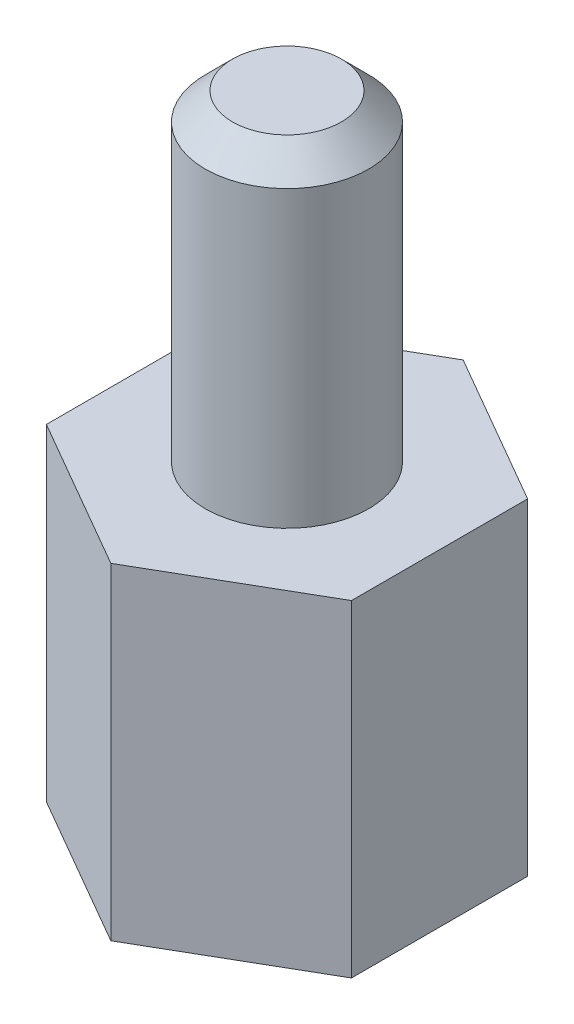
ISO-10303-21;
HEADER;
FILE_DESCRIPTION(('STEP AP214'),'2;1');
FILE_NAME('part.step','',(''),(''),'','','');
FILE_SCHEMA(('AUTOMOTIVE_DESIGN { 1 0 10303 214 1 1 1 1 }'));
ENDSEC;
DATA;
#1=APPLICATION_CONTEXT('core data for automotive mechanical design processes');
#2=APPLICATION_PROTOCOL_DEFINITION('international standard','automotive_design',2000,#1);
#3=PRODUCT_CONTEXT('',#1,'mechanical');
#4=PRODUCT('Part','Part','',(#3));
#5=PRODUCT_RELATED_PRODUCT_CATEGORY('part','',(#4));
#6=PRODUCT_DEFINITION_FORMATION('','',#4);
#7=PRODUCT_DEFINITION_CONTEXT('part definition',#1,'design');
#8=PRODUCT_DEFINITION('design','',#6,#7);
#9=PRODUCT_DEFINITION_SHAPE('','',#8);
#10=(LENGTH_UNIT() NAMED_UNIT(*) SI_UNIT(.MILLI.,.METRE.));
#11=(NAMED_UNIT(*) PLANE_ANGLE_UNIT() SI_UNIT($,.RADIAN.));
#12=(NAMED_UNIT(*) SI_UNIT($,.STERADIAN.) SOLID_ANGLE_UNIT());
#13=UNCERTAINTY_MEASURE_WITH_UNIT(LENGTH_MEASURE(1.E-05),#10,'distance_accuracy_value','');
#14=(GEOMETRIC_REPRESENTATION_CONTEXT(3) GLOBAL_UNCERTAINTY_ASSIGNED_CONTEXT((#13)) GLOBAL_UNIT_ASSIGNED_CONTEXT((#10,
#11,#12)) REPRESENTATION_CONTEXT('',''));
#15=CARTESIAN_POINT('',(0.,0.,0.));
#16=DIRECTION('',(0.,0.,1.));
#17=DIRECTION('',(1.,0.,0.));
#18=AXIS2_PLACEMENT_3D('',#15,#16,#17);
#19=CARTESIAN_POINT('',(-2.79999999999998,6.,1.61658075373099));
#20=DIRECTION('',(0.499999999999995,0.,-0.866025403784441));
#21=DIRECTION('',(-0.866025403784442,0.,-0.499999999999995));
#22=AXIS2_PLACEMENT_3D('',#19,#20,#21);
#23=PLANE('',#22);
#24=DIRECTION('',(0.866025403784442,0.,0.499999999999995));
#25=VECTOR('',#24,1.);
#26=CARTESIAN_POINT('',(-2.79999999999998,0.,1.61658075373099));
#27=LINE('',#26,#25);
#28=CARTESIAN_POINT('',(-2.79999999999998,0.,1.61658075373099));
#29=VERTEX_POINT('',#28);
#30=CARTESIAN_POINT('',(0.,0.,3.23316150746191));
#31=VERTEX_POINT('',#30);
#32=EDGE_CURVE('E135',#29,#31,#27,.T.);
#33=ORIENTED_EDGE('',*,*,#32,.T.);
#34=DIRECTION('',(0.,-1.,0.));
#35=VECTOR('',#34,1.);
#36=CARTESIAN_POINT('',(0.,6.,3.23316150746191));
#37=LINE('',#36,#35);
#38=CARTESIAN_POINT('',(0.,6.,3.23316150746191));
#39=VERTEX_POINT('',#38);
#40=EDGE_CURVE('E163',#39,#31,#37,.T.);
#41=ORIENTED_EDGE('',*,*,#40,.F.);
#42=DIRECTION('',(0.866025403784442,0.,0.499999999999995));
#43=VECTOR('',#42,1.);
#44=CARTESIAN_POINT('',(-2.79999999999998,6.,1.61658075373099));
#45=LINE('',#44,#43);
#46=CARTESIAN_POINT('',(-2.79999999999998,6.,1.61658075373099));
#47=VERTEX_POINT('',#46);
#48=EDGE_CURVE('E152',#47,#39,#45,.T.);
#49=ORIENTED_EDGE('',*,*,#48,.F.);
#50=DIRECTION('',(0.,-1.,0.));
#51=VECTOR('',#50,1.);
#52=CARTESIAN_POINT('',(-2.79999999999998,6.,1.61658075373099));
#53=LINE('',#52,#51);
#54=EDGE_CURVE('E131',#47,#29,#53,.T.);
#55=ORIENTED_EDGE('',*,*,#54,.T.);
#56=EDGE_LOOP('',(#33,#41,#49,#55));
#57=FACE_BOUND('',#56,.T.);
#58=ADVANCED_FACE('F43',(#57),#23,.F.);
#59=CARTESIAN_POINT('',(0.,6.,3.23316150746191));
#60=DIRECTION('',(-0.500000000000001,0.,-0.866025403784438));
#61=DIRECTION('',(-0.866025403784438,0.,0.500000000000001));
#62=AXIS2_PLACEMENT_3D('',#59,#60,#61);
#63=PLANE('',#62);
#64=DIRECTION('',(0.866025403784438,0.,-0.500000000000001));
#65=VECTOR('',#64,1.);
#66=CARTESIAN_POINT('',(0.,0.,3.23316150746191));
#67=LINE('',#66,#65);
#68=CARTESIAN_POINT('',(2.80000000000001,0.,1.61658075373095));
#69=VERTEX_POINT('',#68);
#70=EDGE_CURVE('E139',#31,#69,#67,.T.);
#71=ORIENTED_EDGE('',*,*,#70,.T.);
#72=DIRECTION('',(0.,-1.,0.));
#73=VECTOR('',#72,1.);
#74=CARTESIAN_POINT('',(2.80000000000001,6.,1.61658075373095));
#75=LINE('',#74,#73);
#76=CARTESIAN_POINT('',(2.80000000000001,6.,1.61658075373095));
#77=VERTEX_POINT('',#76);
#78=EDGE_CURVE('E159',#77,#69,#75,.T.);
#79=ORIENTED_EDGE('',*,*,#78,.F.);
#80=DIRECTION('',(0.866025403784438,0.,-0.500000000000001));
#81=VECTOR('',#80,1.);
#82=CARTESIAN_POINT('',(0.,6.,3.23316150746191));
#83=LINE('',#82,#81);
#84=EDGE_CURVE('E100',#39,#77,#83,.T.);
#85=ORIENTED_EDGE('',*,*,#84,.F.);
#86=ORIENTED_EDGE('',*,*,#40,.T.);
#87=EDGE_LOOP('',(#71,#79,#85,#86));
#88=FACE_BOUND('',#87,.T.);
#89=ADVANCED_FACE('F213',(#88),#63,.F.);
#90=CARTESIAN_POINT('',(2.80000000000001,6.,1.61658075373095));
#91=DIRECTION('',(-1.,0.,0.));
#92=DIRECTION('',(0.,0.,1.));
#93=AXIS2_PLACEMENT_3D('',#90,#91,#92);
#94=PLANE('',#93);
#95=DIRECTION('',(0.,0.,-1.));
#96=VECTOR('',#95,1.);
#97=CARTESIAN_POINT('',(2.80000000000001,0.,1.61658075373095));
#98=LINE('',#97,#96);
#99=CARTESIAN_POINT('',(2.79999999999999,0.,-1.61658075373097));
#100=VERTEX_POINT('',#99);
#101=EDGE_CURVE('E143',#69,#100,#98,.T.);
#102=ORIENTED_EDGE('',*,*,#101,.T.);
#103=DIRECTION('',(0.,-1.,0.));
#104=VECTOR('',#103,1.);
#105=CARTESIAN_POINT('',(2.79999999999999,6.,-1.61658075373097));
#106=LINE('',#105,#104);
#107=CARTESIAN_POINT('',(2.79999999999999,6.,-1.61658075373097));
#108=VERTEX_POINT('',#107);
#109=EDGE_CURVE('E124',#108,#100,#106,.T.);
#110=ORIENTED_EDGE('',*,*,#109,.F.);
#111=DIRECTION('',(0.,0.,-1.));
#112=VECTOR('',#111,1.);
#113=CARTESIAN_POINT('',(2.80000000000001,6.,1.61658075373095));
#114=LINE('',#113,#112);
#115=EDGE_CURVE('E113',#77,#108,#114,.T.);
#116=ORIENTED_EDGE('',*,*,#115,.F.);
#117=ORIENTED_EDGE('',*,*,#78,.T.);
#118=EDGE_LOOP('',(#102,#110,#116,#117));
#119=FACE_BOUND('',#118,.T.);
#120=ADVANCED_FACE('F217',(#119),#94,.F.);
#121=CARTESIAN_POINT('',(2.79999999999999,6.,-1.61658075373097));
#122=DIRECTION('',(-0.499999999999995,0.,0.866025403784442));
#123=DIRECTION('',(0.866025403784442,0.,0.499999999999995));
#124=AXIS2_PLACEMENT_3D('',#121,#122,#123);
#125=PLANE('',#124);
#126=DIRECTION('',(-0.866025403784442,0.,-0.499999999999995));
#127=VECTOR('',#126,1.);
#128=CARTESIAN_POINT('',(2.79999999999999,0.,-1.61658075373097));
#129=LINE('',#128,#127);
#130=CARTESIAN_POINT('',(0.,0.,-3.23316150746191));
#131=VERTEX_POINT('',#130);
#132=EDGE_CURVE('E122',#100,#131,#129,.T.);
#133=ORIENTED_EDGE('',*,*,#132,.T.);
#134=DIRECTION('',(0.,-1.,0.));
#135=VECTOR('',#134,1.);
#136=CARTESIAN_POINT('',(0.,6.,-3.23316150746191));
#137=LINE('',#136,#135);
#138=CARTESIAN_POINT('',(0.,6.,-3.23316150746191));
#139=VERTEX_POINT('',#138);
#140=EDGE_CURVE('E119',#139,#131,#137,.T.);
#141=ORIENTED_EDGE('',*,*,#140,.F.);
#142=DIRECTION('',(-0.866025403784442,0.,-0.499999999999995));
#143=VECTOR('',#142,1.);
#144=CARTESIAN_POINT('',(2.79999999999999,6.,-1.61658075373097));
#145=LINE('',#144,#143);
#146=EDGE_CURVE('E107',#108,#139,#145,.T.);
#147=ORIENTED_EDGE('',*,*,#146,.F.);
#148=ORIENTED_EDGE('',*,*,#109,.T.);
#149=EDGE_LOOP('',(#133,#141,#147,#148));
#150=FACE_BOUND('',#149,.T.);
#151=ADVANCED_FACE('F120',(#150),#125,.F.);
#152=CARTESIAN_POINT('',(0.,6.,-3.23316150746191));
#153=DIRECTION('',(0.500000000000007,0.,0.866025403784435));
#154=DIRECTION('',(0.866025403784435,0.,-0.500000000000007));
#155=AXIS2_PLACEMENT_3D('',#152,#153,#154);
#156=PLANE('',#155);
#157=DIRECTION('',(-0.866025403784435,0.,0.500000000000007));
#158=VECTOR('',#157,1.);
#159=CARTESIAN_POINT('',(0.,0.,-3.23316150746191));
#160=LINE('',#159,#158);
#161=CARTESIAN_POINT('',(-2.80000000000002,0.,-1.61658075373093));
#162=VERTEX_POINT('',#161);
#163=EDGE_CURVE('E85',#131,#162,#160,.T.);
#164=ORIENTED_EDGE('',*,*,#163,.T.);
#165=DIRECTION('',(0.,-1.,0.));
#166=VECTOR('',#165,1.);
#167=CARTESIAN_POINT('',(-2.80000000000002,6.,-1.61658075373093));
#168=LINE('',#167,#166);
#169=CARTESIAN_POINT('',(-2.80000000000002,6.,-1.61658075373093));
#170=VERTEX_POINT('',#169);
#171=EDGE_CURVE('E125',#170,#162,#168,.T.);
#172=ORIENTED_EDGE('',*,*,#171,.F.);
#173=DIRECTION('',(-0.866025403784435,0.,0.500000000000007));
#174=VECTOR('',#173,1.);
#175=CARTESIAN_POINT('',(0.,6.,-3.23316150746191));
#176=LINE('',#175,#174);
#177=EDGE_CURVE('E111',#139,#170,#176,.T.);
#178=ORIENTED_EDGE('',*,*,#177,.F.);
#179=ORIENTED_EDGE('',*,*,#140,.T.);
#180=EDGE_LOOP('',(#164,#172,#178,#179));
#181=FACE_BOUND('',#180,.T.);
#182=ADVANCED_FACE('F127',(#181),#156,.F.);
#183=CARTESIAN_POINT('',(-2.80000000000002,6.,-1.61658075373093));
#184=DIRECTION('',(1.,0.,0.));
#185=DIRECTION('',(0.,0.,-1.));
#186=AXIS2_PLACEMENT_3D('',#183,#184,#185);
#187=PLANE('',#186);
#188=DIRECTION('',(0.,0.,1.));
#189=VECTOR('',#188,1.);
#190=CARTESIAN_POINT('',(-2.80000000000002,0.,-1.61658075373093));
#191=LINE('',#190,#189);
#192=EDGE_CURVE('E91',#162,#29,#191,.T.);
#193=ORIENTED_EDGE('',*,*,#192,.T.);
#194=ORIENTED_EDGE('',*,*,#54,.F.);
#195=DIRECTION('',(0.,0.,1.));
#196=VECTOR('',#195,1.);
#197=CARTESIAN_POINT('',(-2.80000000000002,6.,-1.61658075373093));
#198=LINE('',#197,#196);
#199=EDGE_CURVE('E62',#170,#47,#198,.T.);
#200=ORIENTED_EDGE('',*,*,#199,.F.);
#201=ORIENTED_EDGE('',*,*,#171,.T.);
#202=EDGE_LOOP('',(#193,#194,#200,#201));
#203=FACE_BOUND('',#202,.T.);
#204=ADVANCED_FACE('F202',(#203),#187,.F.);
#205=CARTESIAN_POINT('',(0.,6.,0.));
#206=DIRECTION('',(0.,1.,0.));
#207=DIRECTION('',(0.,0.,1.));
#208=AXIS2_PLACEMENT_3D('',#205,#206,#207);
#209=PLANE('',#208);
#210=CARTESIAN_POINT('',(0.,6.,0.));
#211=DIRECTION('',(0.,1.,0.));
#212=DIRECTION('',(0.,0.,1.));
#213=AXIS2_PLACEMENT_3D('',#210,#211,#212);
#214=CIRCLE('',#213,1.5);
#215=CARTESIAN_POINT('',(0.,6.,1.5));
#216=VERTEX_POINT('',#215);
#217=EDGE_CURVE('E165',#216,#216,#214,.T.);
#218=ORIENTED_EDGE('',*,*,#217,.F.);
#219=EDGE_LOOP('',(#218));
#220=FACE_BOUND('',#219,.T.);
#221=ORIENTED_EDGE('',*,*,#48,.T.);
#222=ORIENTED_EDGE('',*,*,#84,.T.);
#223=ORIENTED_EDGE('',*,*,#115,.T.);
#224=ORIENTED_EDGE('',*,*,#146,.T.);
#225=ORIENTED_EDGE('',*,*,#177,.T.);
#226=ORIENTED_EDGE('',*,*,#199,.T.);
#227=EDGE_LOOP('',(#221,#222,#223,#224,#225,#226));
#228=FACE_BOUND('',#227,.T.);
#229=ADVANCED_FACE('F109',(#220,#228),#209,.T.);
#230=CARTESIAN_POINT('',(0.,0.,0.));
#231=DIRECTION('',(0.,1.,0.));
#232=DIRECTION('',(0.,0.,1.));
#233=AXIS2_PLACEMENT_3D('',#230,#231,#232);
#234=PLANE('',#233);
#235=CARTESIAN_POINT('',(0.,0.,0.));
#236=DIRECTION('',(0.,-1.,0.));
#237=DIRECTION('',(0.,0.,-1.));
#238=AXIS2_PLACEMENT_3D('',#235,#236,#237);
#239=CIRCLE('',#238,1.5);
#240=CARTESIAN_POINT('',(0.,0.,-1.5));
#241=VERTEX_POINT('',#240);
#242=EDGE_CURVE('E185',#241,#241,#239,.T.);
#243=ORIENTED_EDGE('',*,*,#242,.F.);
#244=EDGE_LOOP('',(#243));
#245=FACE_BOUND('',#244,.T.);
#246=ORIENTED_EDGE('',*,*,#32,.F.);
#247=ORIENTED_EDGE('',*,*,#192,.F.);
#248=ORIENTED_EDGE('',*,*,#163,.F.);
#249=ORIENTED_EDGE('',*,*,#132,.F.);
#250=ORIENTED_EDGE('',*,*,#101,.F.);
#251=ORIENTED_EDGE('',*,*,#70,.F.);
#252=EDGE_LOOP('',(#246,#247,#248,#249,#250,#251));
#253=FACE_BOUND('',#252,.T.);
#254=ADVANCED_FACE('F192',(#245,#253),#234,.F.);
#255=CARTESIAN_POINT('',(0.,11.9,0.));
#256=DIRECTION('',(0.,-1.,0.));
#257=DIRECTION('',(0.,0.,-1.));
#258=AXIS2_PLACEMENT_3D('',#255,#256,#257);
#259=CYLINDRICAL_SURFACE('',#258,1.5);
#260=CARTESIAN_POINT('',(0.,11.4,0.));
#261=DIRECTION('',(0.,1.,0.));
#262=DIRECTION('',(0.,0.,1.));
#263=AXIS2_PLACEMENT_3D('',#260,#261,#262);
#264=CIRCLE('',#263,1.5);
#265=CARTESIAN_POINT('',(0.,11.4,1.5));
#266=VERTEX_POINT('',#265);
#267=EDGE_CURVE('E12',#266,#266,#264,.F.);
#268=ORIENTED_EDGE('',*,*,#267,.T.);
#269=EDGE_LOOP('',(#268));
#270=FACE_BOUND('',#269,.T.);
#271=ORIENTED_EDGE('',*,*,#217,.T.);
#272=EDGE_LOOP('',(#271));
#273=FACE_BOUND('',#272,.T.);
#274=ADVANCED_FACE('F195',(#270,#273),#259,.T.);
#275=CARTESIAN_POINT('',(0.,11.9,0.));
#276=DIRECTION('',(0.,1.,0.));
#277=DIRECTION('',(0.,0.,1.));
#278=AXIS2_PLACEMENT_3D('',#275,#276,#277);
#279=PLANE('',#278);
#280=CARTESIAN_POINT('',(0.,11.9,0.));
#281=DIRECTION('',(0.,1.,0.));
#282=DIRECTION('',(0.,0.,1.));
#283=AXIS2_PLACEMENT_3D('',#280,#281,#282);
#284=CIRCLE('',#283,0.999999999999997);
#285=CARTESIAN_POINT('',(0.,11.9,0.999999999999997));
#286=VERTEX_POINT('',#285);
#287=EDGE_CURVE('E54',#286,#286,#284,.T.);
#288=ORIENTED_EDGE('',*,*,#287,.T.);
#289=EDGE_LOOP('',(#288));
#290=FACE_BOUND('',#289,.T.);
#291=ADVANCED_FACE('F260',(#290),#279,.T.);
#292=CARTESIAN_POINT('',(0.,4.,0.));
#293=DIRECTION('',(0.,1.,0.));
#294=DIRECTION('',(0.,0.,1.));
#295=AXIS2_PLACEMENT_3D('',#292,#293,#294);
#296=PLANE('',#295);
#297=CARTESIAN_POINT('',(0.,4.,0.));
#298=DIRECTION('',(0.,1.,0.));
#299=DIRECTION('',(0.,0.,1.));
#300=AXIS2_PLACEMENT_3D('',#297,#298,#299);
#301=CIRCLE('',#300,1.5);
#302=CARTESIAN_POINT('',(0.,4.,1.5));
#303=VERTEX_POINT('',#302);
#304=EDGE_CURVE('E140',#303,#303,#301,.F.);
#305=ORIENTED_EDGE('',*,*,#304,.T.);
#306=EDGE_LOOP('',(#305));
#307=FACE_BOUND('',#306,.T.);
#308=ADVANCED_FACE('F255',(#307),#296,.F.);
#309=CARTESIAN_POINT('',(0.,10.2426406871193,0.));
#310=DIRECTION('',(0.,-1.,0.));
#311=DIRECTION('',(0.,0.,-1.));
#312=AXIS2_PLACEMENT_3D('',#309,#310,#311);
#313=CYLINDRICAL_SURFACE('',#312,1.5);
#314=ORIENTED_EDGE('',*,*,#242,.T.);
#315=EDGE_LOOP('',(#314));
#316=FACE_BOUND('',#315,.T.);
#317=ORIENTED_EDGE('',*,*,#304,.F.);
#318=EDGE_LOOP('',(#317));
#319=FACE_BOUND('',#318,.T.);
#320=ADVANCED_FACE('F189',(#316,#319),#313,.F.);
#321=CARTESIAN_POINT('',(0.,11.9,0.));
#322=DIRECTION('',(0.,-1.,0.));
#323=DIRECTION('',(0.,0.,-1.));
#324=AXIS2_PLACEMENT_3D('',#321,#322,#323);
#325=CONICAL_SURFACE('',#324,0.999999999999997,0.785398163397447);
#326=ORIENTED_EDGE('',*,*,#267,.F.);
#327=EDGE_LOOP('',(#326));
#328=FACE_BOUND('',#327,.T.);
#329=ORIENTED_EDGE('',*,*,#287,.F.);
#330=EDGE_LOOP('',(#329));
#331=FACE_BOUND('',#330,.T.);
#332=ADVANCED_FACE('F46',(#328,#331),#325,.T.);
#333=CLOSED_SHELL('',(#58,#89,#120,#151,#182,#204,#229,#254,#274,#291,#308,#320,#332));
#334=MANIFOLD_SOLID_BREP('B2',#333);
#335=ADVANCED_BREP_SHAPE_REPRESENTATION('',(#18,#334),#14);
#336=SHAPE_DEFINITION_REPRESENTATION(#9,#335);
ENDSEC;
END-ISO-10303-21;
